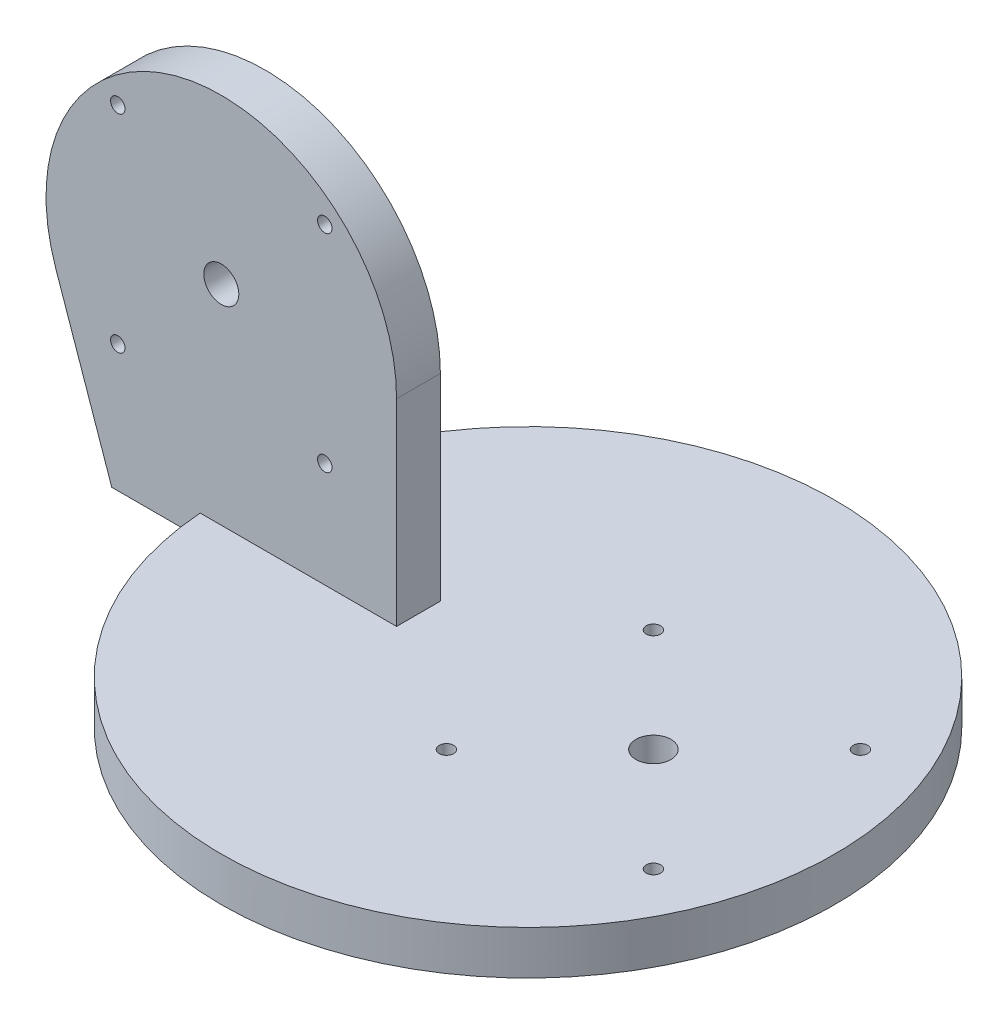
ISO-10303-21;
HEADER;
FILE_DESCRIPTION(('STEP AP214'),'2;1');
FILE_NAME('part.step','',(''),(''),'','','');
FILE_SCHEMA(('AUTOMOTIVE_DESIGN { 1 0 10303 214 1 1 1 1 }'));
ENDSEC;
DATA;
#1=APPLICATION_CONTEXT('core data for automotive mechanical design processes');
#2=APPLICATION_PROTOCOL_DEFINITION('international standard','automotive_design',2000,#1);
#3=PRODUCT_CONTEXT('',#1,'mechanical');
#4=PRODUCT('Part','Part','',(#3));
#5=PRODUCT_RELATED_PRODUCT_CATEGORY('part','',(#4));
#6=PRODUCT_DEFINITION_FORMATION('','',#4);
#7=PRODUCT_DEFINITION_CONTEXT('part definition',#1,'design');
#8=PRODUCT_DEFINITION('design','',#6,#7);
#9=PRODUCT_DEFINITION_SHAPE('','',#8);
#10=(LENGTH_UNIT() NAMED_UNIT(*) SI_UNIT(.MILLI.,.METRE.));
#11=(NAMED_UNIT(*) PLANE_ANGLE_UNIT() SI_UNIT($,.RADIAN.));
#12=(NAMED_UNIT(*) SI_UNIT($,.STERADIAN.) SOLID_ANGLE_UNIT());
#13=UNCERTAINTY_MEASURE_WITH_UNIT(LENGTH_MEASURE(1.E-05),#10,'distance_accuracy_value','');
#14=(GEOMETRIC_REPRESENTATION_CONTEXT(3) GLOBAL_UNCERTAINTY_ASSIGNED_CONTEXT((#13)) GLOBAL_UNIT_ASSIGNED_CONTEXT((#10,
#11,#12)) REPRESENTATION_CONTEXT('',''));
#15=CARTESIAN_POINT('',(0.,0.,0.));
#16=DIRECTION('',(0.,0.,1.));
#17=DIRECTION('',(1.,0.,0.));
#18=AXIS2_PLACEMENT_3D('',#15,#16,#17);
#19=CARTESIAN_POINT('',(0.,10.,0.));
#20=DIRECTION('',(0.,-1.,0.));
#21=DIRECTION('',(0.,0.,-1.));
#22=AXIS2_PLACEMENT_3D('',#19,#20,#21);
#23=CYLINDRICAL_SURFACE('',#22,70.);
#24=CARTESIAN_POINT('',(0.,0.,0.));
#25=DIRECTION('',(0.,1.,0.));
#26=DIRECTION('',(0.,0.,1.));
#27=AXIS2_PLACEMENT_3D('',#24,#25,#26);
#28=CIRCLE('',#27,70.);
#29=CARTESIAN_POINT('',(0.,0.,70.));
#30=VERTEX_POINT('',#29);
#31=EDGE_CURVE('E198',#30,#30,#28,.T.);
#32=ORIENTED_EDGE('',*,*,#31,.T.);
#33=EDGE_LOOP('',(#32));
#34=FACE_BOUND('',#33,.T.);
#35=DIRECTION('',(0.,-1.,0.));
#36=VECTOR('',#35,1.);
#37=CARTESIAN_POINT('',(-69.8212002188447,10.,5.));
#38=LINE('',#37,#36);
#39=CARTESIAN_POINT('',(-69.8212002188447,4.99999999999999,5.));
#40=VERTEX_POINT('',#39);
#41=CARTESIAN_POINT('',(-69.8212002188447,10.,5.));
#42=VERTEX_POINT('',#41);
#43=EDGE_CURVE('E79',#40,#42,#38,.F.);
#44=ORIENTED_EDGE('',*,*,#43,.F.);
#45=CARTESIAN_POINT('',(0.,5.,0.));
#46=DIRECTION('',(0.,1.,0.));
#47=DIRECTION('',(-1.,0.,0.));
#48=AXIS2_PLACEMENT_3D('',#45,#46,#47);
#49=CIRCLE('',#48,70.);
#50=CARTESIAN_POINT('',(-69.8212002188447,4.99999999999999,-5.));
#51=VERTEX_POINT('',#50);
#52=EDGE_CURVE('E12',#51,#40,#49,.T.);
#53=ORIENTED_EDGE('',*,*,#52,.F.);
#54=DIRECTION('',(0.,-1.,0.));
#55=VECTOR('',#54,1.);
#56=CARTESIAN_POINT('',(-69.8212002188447,10.,-5.));
#57=LINE('',#56,#55);
#58=CARTESIAN_POINT('',(-69.8212002188447,10.,-5.));
#59=VERTEX_POINT('',#58);
#60=EDGE_CURVE('E189',#51,#59,#57,.F.);
#61=ORIENTED_EDGE('',*,*,#60,.T.);
#62=CARTESIAN_POINT('',(0.,10.,0.));
#63=DIRECTION('',(0.,1.,0.));
#64=DIRECTION('',(0.,0.,1.));
#65=AXIS2_PLACEMENT_3D('',#62,#63,#64);
#66=CIRCLE('',#65,70.);
#67=EDGE_CURVE('E199',#42,#59,#66,.T.);
#68=ORIENTED_EDGE('',*,*,#67,.F.);
#69=EDGE_LOOP('',(#44,#53,#61,#68));
#70=FACE_BOUND('',#69,.T.);
#71=ADVANCED_FACE('F63',(#34,#70),#23,.T.);
#72=CARTESIAN_POINT('',(0.,10.,0.));
#73=DIRECTION('',(0.,1.,0.));
#74=DIRECTION('',(0.,0.,1.));
#75=AXIS2_PLACEMENT_3D('',#72,#73,#74);
#76=PLANE('',#75);
#77=CARTESIAN_POINT('',(28.62,10.,0.));
#78=DIRECTION('',(0.,1.,0.));
#79=DIRECTION('',(0.,0.,1.));
#80=AXIS2_PLACEMENT_3D('',#77,#78,#79);
#81=CIRCLE('',#80,4.);
#82=CARTESIAN_POINT('',(28.62,10.,4.));
#83=VERTEX_POINT('',#82);
#84=EDGE_CURVE('E212',#83,#83,#81,.T.);
#85=ORIENTED_EDGE('',*,*,#84,.F.);
#86=EDGE_LOOP('',(#85));
#87=FACE_BOUND('',#86,.T.);
#88=CARTESIAN_POINT('',(5.,10.,-23.62));
#89=DIRECTION('',(0.,1.,0.));
#90=DIRECTION('',(0.,0.,1.));
#91=AXIS2_PLACEMENT_3D('',#88,#89,#90);
#92=CIRCLE('',#91,1.64999999999999);
#93=CARTESIAN_POINT('',(5.,10.,-21.97));
#94=VERTEX_POINT('',#93);
#95=EDGE_CURVE('E136',#94,#94,#92,.T.);
#96=ORIENTED_EDGE('',*,*,#95,.F.);
#97=EDGE_LOOP('',(#96));
#98=FACE_BOUND('',#97,.T.);
#99=CARTESIAN_POINT('',(52.24,10.,-23.62));
#100=DIRECTION('',(0.,1.,0.));
#101=DIRECTION('',(0.,0.,1.));
#102=AXIS2_PLACEMENT_3D('',#99,#100,#101);
#103=CIRCLE('',#102,1.64999999999999);
#104=CARTESIAN_POINT('',(52.24,10.,-21.97));
#105=VERTEX_POINT('',#104);
#106=EDGE_CURVE('E135',#105,#105,#103,.T.);
#107=ORIENTED_EDGE('',*,*,#106,.F.);
#108=EDGE_LOOP('',(#107));
#109=FACE_BOUND('',#108,.T.);
#110=CARTESIAN_POINT('',(52.24,10.,23.62));
#111=DIRECTION('',(0.,1.,0.));
#112=DIRECTION('',(0.,0.,1.));
#113=AXIS2_PLACEMENT_3D('',#110,#111,#112);
#114=CIRCLE('',#113,1.64999999999999);
#115=CARTESIAN_POINT('',(52.24,10.,25.27));
#116=VERTEX_POINT('',#115);
#117=EDGE_CURVE('E148',#116,#116,#114,.T.);
#118=ORIENTED_EDGE('',*,*,#117,.F.);
#119=EDGE_LOOP('',(#118));
#120=FACE_BOUND('',#119,.T.);
#121=CARTESIAN_POINT('',(5.,10.,23.62));
#122=DIRECTION('',(0.,1.,0.));
#123=DIRECTION('',(0.,0.,1.));
#124=AXIS2_PLACEMENT_3D('',#121,#122,#123);
#125=CIRCLE('',#124,1.64999999999999);
#126=CARTESIAN_POINT('',(5.,10.,25.27));
#127=VERTEX_POINT('',#126);
#128=EDGE_CURVE('E154',#127,#127,#125,.T.);
#129=ORIENTED_EDGE('',*,*,#128,.F.);
#130=EDGE_LOOP('',(#129));
#131=FACE_BOUND('',#130,.T.);
#132=DIRECTION('',(0.,0.,1.));
#133=VECTOR('',#132,1.);
#134=CARTESIAN_POINT('',(-25.,10.,0.));
#135=LINE('',#134,#133);
#136=CARTESIAN_POINT('',(-25.,10.,-5.));
#137=VERTEX_POINT('',#136);
#138=CARTESIAN_POINT('',(-25.,10.,5.));
#139=VERTEX_POINT('',#138);
#140=EDGE_CURVE('E206',#137,#139,#135,.T.);
#141=ORIENTED_EDGE('',*,*,#140,.T.);
#142=DIRECTION('',(-1.,0.,0.));
#143=VECTOR('',#142,1.);
#144=CARTESIAN_POINT('',(0.,10.,5.));
#145=LINE('',#144,#143);
#146=EDGE_CURVE('E71',#139,#42,#145,.T.);
#147=ORIENTED_EDGE('',*,*,#146,.T.);
#148=ORIENTED_EDGE('',*,*,#67,.T.);
#149=DIRECTION('',(-1.,0.,0.));
#150=VECTOR('',#149,1.);
#151=CARTESIAN_POINT('',(0.,10.,-5.));
#152=LINE('',#151,#150);
#153=EDGE_CURVE('E201',#137,#59,#152,.T.);
#154=ORIENTED_EDGE('',*,*,#153,.F.);
#155=EDGE_LOOP('',(#141,#147,#148,#154));
#156=FACE_BOUND('',#155,.T.);
#157=ADVANCED_FACE('F254',(#87,#98,#109,#120,#131,#156),#76,.T.);
#158=CARTESIAN_POINT('',(0.,0.,0.));
#159=DIRECTION('',(0.,1.,0.));
#160=DIRECTION('',(0.,0.,1.));
#161=AXIS2_PLACEMENT_3D('',#158,#159,#160);
#162=PLANE('',#161);
#163=CARTESIAN_POINT('',(0.,0.,0.));
#164=DIRECTION('',(0.,1.,0.));
#165=DIRECTION('',(0.,0.,1.));
#166=AXIS2_PLACEMENT_3D('',#163,#164,#165);
#167=CIRCLE('',#166,65.);
#168=CARTESIAN_POINT('',(0.,0.,65.));
#169=VERTEX_POINT('',#168);
#170=EDGE_CURVE('E192',#169,#169,#167,.T.);
#171=ORIENTED_EDGE('',*,*,#170,.T.);
#172=EDGE_LOOP('',(#171));
#173=FACE_BOUND('',#172,.T.);
#174=ORIENTED_EDGE('',*,*,#31,.F.);
#175=EDGE_LOOP('',(#174));
#176=FACE_BOUND('',#175,.T.);
#177=ADVANCED_FACE('F257',(#173,#176),#162,.F.);
#178=CARTESIAN_POINT('',(0.,-3.,0.));
#179=DIRECTION('',(0.,-1.,0.));
#180=DIRECTION('',(0.,0.,-1.));
#181=AXIS2_PLACEMENT_3D('',#178,#179,#180);
#182=PLANE('',#181);
#183=CARTESIAN_POINT('',(28.62,-3.,0.));
#184=DIRECTION('',(0.,1.,0.));
#185=DIRECTION('',(0.,0.,1.));
#186=AXIS2_PLACEMENT_3D('',#183,#184,#185);
#187=CIRCLE('',#186,3.99999999999999);
#188=CARTESIAN_POINT('',(28.62,-3.,3.99999999999999));
#189=VERTEX_POINT('',#188);
#190=EDGE_CURVE('E142',#189,#189,#187,.T.);
#191=ORIENTED_EDGE('',*,*,#190,.T.);
#192=EDGE_LOOP('',(#191));
#193=FACE_BOUND('',#192,.T.);
#194=CARTESIAN_POINT('',(0.,-3.,0.));
#195=DIRECTION('',(0.,1.,0.));
#196=DIRECTION('',(0.,0.,1.));
#197=AXIS2_PLACEMENT_3D('',#194,#195,#196);
#198=CIRCLE('',#197,65.);
#199=CARTESIAN_POINT('',(0.,-3.,65.));
#200=VERTEX_POINT('',#199);
#201=EDGE_CURVE('E195',#200,#200,#198,.T.);
#202=ORIENTED_EDGE('',*,*,#201,.F.);
#203=EDGE_LOOP('',(#202));
#204=FACE_BOUND('',#203,.T.);
#205=ADVANCED_FACE('F244',(#193,#204),#182,.T.);
#206=CARTESIAN_POINT('',(0.,0.,0.));
#207=DIRECTION('',(0.,-1.,0.));
#208=DIRECTION('',(0.,0.,-1.));
#209=AXIS2_PLACEMENT_3D('',#206,#207,#208);
#210=CYLINDRICAL_SURFACE('',#209,65.);
#211=ORIENTED_EDGE('',*,*,#170,.F.);
#212=EDGE_LOOP('',(#211));
#213=FACE_BOUND('',#212,.T.);
#214=ORIENTED_EDGE('',*,*,#201,.T.);
#215=EDGE_LOOP('',(#214));
#216=FACE_BOUND('',#215,.T.);
#217=ADVANCED_FACE('F298',(#213,#216),#210,.T.);
#218=CARTESIAN_POINT('',(-65.,55.,5.));
#219=DIRECTION('',(0.,0.,-1.));
#220=DIRECTION('',(-1.,0.,0.));
#221=AXIS2_PLACEMENT_3D('',#218,#219,#220);
#222=PLANE('',#221);
#223=CARTESIAN_POINT('',(-88.62,81.2592930906025,5.));
#224=DIRECTION('',(0.,0.,1.));
#225=DIRECTION('',(1.,0.,0.));
#226=AXIS2_PLACEMENT_3D('',#223,#224,#225);
#227=CIRCLE('',#226,1.64999999999998);
#228=CARTESIAN_POINT('',(-86.97,81.2592930906025,5.));
#229=VERTEX_POINT('',#228);
#230=EDGE_CURVE('E233',#229,#229,#227,.T.);
#231=ORIENTED_EDGE('',*,*,#230,.F.);
#232=EDGE_LOOP('',(#231));
#233=FACE_BOUND('',#232,.T.);
#234=CARTESIAN_POINT('',(-41.38,81.2592930906025,5.));
#235=DIRECTION('',(0.,0.,1.));
#236=DIRECTION('',(1.,0.,0.));
#237=AXIS2_PLACEMENT_3D('',#234,#235,#236);
#238=CIRCLE('',#237,1.64999999999999);
#239=CARTESIAN_POINT('',(-39.73,81.2592930906025,5.));
#240=VERTEX_POINT('',#239);
#241=EDGE_CURVE('E223',#240,#240,#238,.T.);
#242=ORIENTED_EDGE('',*,*,#241,.F.);
#243=EDGE_LOOP('',(#242));
#244=FACE_BOUND('',#243,.T.);
#245=CARTESIAN_POINT('',(-41.38,34.0192930906024,5.));
#246=DIRECTION('',(0.,0.,1.));
#247=DIRECTION('',(1.,0.,0.));
#248=AXIS2_PLACEMENT_3D('',#245,#246,#247);
#249=CIRCLE('',#248,1.64999999999999);
#250=CARTESIAN_POINT('',(-39.73,34.0192930906024,5.));
#251=VERTEX_POINT('',#250);
#252=EDGE_CURVE('E220',#251,#251,#249,.T.);
#253=ORIENTED_EDGE('',*,*,#252,.F.);
#254=EDGE_LOOP('',(#253));
#255=FACE_BOUND('',#254,.T.);
#256=CARTESIAN_POINT('',(-88.62,34.0192930906024,5.));
#257=DIRECTION('',(0.,0.,1.));
#258=DIRECTION('',(1.,0.,0.));
#259=AXIS2_PLACEMENT_3D('',#256,#257,#258);
#260=CIRCLE('',#259,1.64999999999998);
#261=CARTESIAN_POINT('',(-86.97,34.0192930906024,5.));
#262=VERTEX_POINT('',#261);
#263=EDGE_CURVE('E217',#262,#262,#260,.T.);
#264=ORIENTED_EDGE('',*,*,#263,.F.);
#265=EDGE_LOOP('',(#264));
#266=FACE_BOUND('',#265,.T.);
#267=CARTESIAN_POINT('',(-65.,57.6392930906025,5.));
#268=DIRECTION('',(0.,0.,1.));
#269=DIRECTION('',(1.,0.,0.));
#270=AXIS2_PLACEMENT_3D('',#267,#268,#269);
#271=CIRCLE('',#270,4.);
#272=CARTESIAN_POINT('',(-61.,57.6392930906025,5.));
#273=VERTEX_POINT('',#272);
#274=EDGE_CURVE('E213',#273,#273,#271,.T.);
#275=ORIENTED_EDGE('',*,*,#274,.F.);
#276=EDGE_LOOP('',(#275));
#277=FACE_BOUND('',#276,.T.);
#278=DIRECTION('',(1.,0.,0.));
#279=VECTOR('',#278,1.);
#280=CARTESIAN_POINT('',(-25.,4.99999999999999,5.));
#281=LINE('',#280,#279);
#282=CARTESIAN_POINT('',(-90.,4.99999999999999,5.));
#283=VERTEX_POINT('',#282);
#284=EDGE_CURVE('E167',#283,#40,#281,.T.);
#285=ORIENTED_EDGE('',*,*,#284,.T.);
#286=ORIENTED_EDGE('',*,*,#43,.T.);
#287=ORIENTED_EDGE('',*,*,#146,.F.);
#288=DIRECTION('',(0.,1.,0.));
#289=VECTOR('',#288,1.);
#290=CARTESIAN_POINT('',(-25.,55.,5.));
#291=LINE('',#290,#289);
#292=CARTESIAN_POINT('',(-25.,55.,5.));
#293=VERTEX_POINT('',#292);
#294=EDGE_CURVE('E170',#139,#293,#291,.T.);
#295=ORIENTED_EDGE('',*,*,#294,.T.);
#296=CARTESIAN_POINT('',(-65.,55.,5.));
#297=DIRECTION('',(0.,0.,1.));
#298=DIRECTION('',(-1.,0.,0.));
#299=AXIS2_PLACEMENT_3D('',#296,#297,#298);
#300=CIRCLE('',#299,40.);
#301=CARTESIAN_POINT('',(-102.792798962901,41.8963994814506,5.));
#302=VERTEX_POINT('',#301);
#303=EDGE_CURVE('E161',#293,#302,#300,.T.);
#304=ORIENTED_EDGE('',*,*,#303,.T.);
#305=DIRECTION('',(0.327590012963735,-0.944819974072532,0.));
#306=VECTOR('',#305,1.);
#307=CARTESIAN_POINT('',(-90.,4.99999999999999,5.));
#308=LINE('',#307,#306);
#309=EDGE_CURVE('E164',#302,#283,#308,.T.);
#310=ORIENTED_EDGE('',*,*,#309,.T.);
#311=EDGE_LOOP('',(#285,#286,#287,#295,#304,#310));
#312=FACE_BOUND('',#311,.T.);
#313=ADVANCED_FACE('F273',(#233,#244,#255,#266,#277,#312),#222,.F.);
#314=CARTESIAN_POINT('',(-65.,55.,-5.));
#315=DIRECTION('',(0.,0.,-1.));
#316=DIRECTION('',(-1.,0.,0.));
#317=AXIS2_PLACEMENT_3D('',#314,#315,#316);
#318=PLANE('',#317);
#319=CARTESIAN_POINT('',(-88.62,81.2592930906025,-5.));
#320=DIRECTION('',(0.,0.,-1.));
#321=DIRECTION('',(-1.,0.,0.));
#322=AXIS2_PLACEMENT_3D('',#319,#320,#321);
#323=CIRCLE('',#322,1.64999999999998);
#324=CARTESIAN_POINT('',(-90.27,81.2592930906025,-5.));
#325=VERTEX_POINT('',#324);
#326=EDGE_CURVE('E66',#325,#325,#323,.T.);
#327=ORIENTED_EDGE('',*,*,#326,.F.);
#328=EDGE_LOOP('',(#327));
#329=FACE_BOUND('',#328,.T.);
#330=CARTESIAN_POINT('',(-41.38,81.2592930906025,-5.));
#331=DIRECTION('',(0.,0.,-1.));
#332=DIRECTION('',(-1.,0.,0.));
#333=AXIS2_PLACEMENT_3D('',#330,#331,#332);
#334=CIRCLE('',#333,1.64999999999999);
#335=CARTESIAN_POINT('',(-43.03,81.2592930906025,-5.));
#336=VERTEX_POINT('',#335);
#337=EDGE_CURVE('E221',#336,#336,#334,.T.);
#338=ORIENTED_EDGE('',*,*,#337,.F.);
#339=EDGE_LOOP('',(#338));
#340=FACE_BOUND('',#339,.T.);
#341=CARTESIAN_POINT('',(-41.38,34.0192930906024,-5.));
#342=DIRECTION('',(0.,0.,-1.));
#343=DIRECTION('',(-1.,0.,0.));
#344=AXIS2_PLACEMENT_3D('',#341,#342,#343);
#345=CIRCLE('',#344,1.64999999999999);
#346=CARTESIAN_POINT('',(-43.03,34.0192930906024,-5.));
#347=VERTEX_POINT('',#346);
#348=EDGE_CURVE('E218',#347,#347,#345,.T.);
#349=ORIENTED_EDGE('',*,*,#348,.F.);
#350=EDGE_LOOP('',(#349));
#351=FACE_BOUND('',#350,.T.);
#352=CARTESIAN_POINT('',(-88.62,34.0192930906024,-5.));
#353=DIRECTION('',(0.,0.,-1.));
#354=DIRECTION('',(-1.,0.,0.));
#355=AXIS2_PLACEMENT_3D('',#352,#353,#354);
#356=CIRCLE('',#355,1.64999999999998);
#357=CARTESIAN_POINT('',(-90.27,34.0192930906024,-5.));
#358=VERTEX_POINT('',#357);
#359=EDGE_CURVE('E214',#358,#358,#356,.T.);
#360=ORIENTED_EDGE('',*,*,#359,.F.);
#361=EDGE_LOOP('',(#360));
#362=FACE_BOUND('',#361,.T.);
#363=CARTESIAN_POINT('',(-65.,57.6392930906025,-5.));
#364=DIRECTION('',(0.,0.,-1.));
#365=DIRECTION('',(-1.,0.,0.));
#366=AXIS2_PLACEMENT_3D('',#363,#364,#365);
#367=CIRCLE('',#366,3.99999999999999);
#368=CARTESIAN_POINT('',(-69.,57.6392930906025,-5.));
#369=VERTEX_POINT('',#368);
#370=EDGE_CURVE('E209',#369,#369,#367,.T.);
#371=ORIENTED_EDGE('',*,*,#370,.F.);
#372=EDGE_LOOP('',(#371));
#373=FACE_BOUND('',#372,.T.);
#374=ORIENTED_EDGE('',*,*,#60,.F.);
#375=DIRECTION('',(1.,0.,0.));
#376=VECTOR('',#375,1.);
#377=CARTESIAN_POINT('',(-25.,4.99999999999999,-5.));
#378=LINE('',#377,#376);
#379=CARTESIAN_POINT('',(-90.,4.99999999999999,-5.));
#380=VERTEX_POINT('',#379);
#381=EDGE_CURVE('E177',#380,#51,#378,.T.);
#382=ORIENTED_EDGE('',*,*,#381,.F.);
#383=DIRECTION('',(0.327590012963735,-0.944819974072532,0.));
#384=VECTOR('',#383,1.);
#385=CARTESIAN_POINT('',(-90.,4.99999999999999,-5.));
#386=LINE('',#385,#384);
#387=CARTESIAN_POINT('',(-102.792798962901,41.8963994814506,-5.));
#388=VERTEX_POINT('',#387);
#389=EDGE_CURVE('E175',#388,#380,#386,.T.);
#390=ORIENTED_EDGE('',*,*,#389,.F.);
#391=CARTESIAN_POINT('',(-65.,55.,-5.));
#392=DIRECTION('',(0.,0.,1.));
#393=DIRECTION('',(-1.,0.,0.));
#394=AXIS2_PLACEMENT_3D('',#391,#392,#393);
#395=CIRCLE('',#394,40.);
#396=CARTESIAN_POINT('',(-25.,55.,-5.));
#397=VERTEX_POINT('',#396);
#398=EDGE_CURVE('E160',#397,#388,#395,.T.);
#399=ORIENTED_EDGE('',*,*,#398,.F.);
#400=DIRECTION('',(0.,1.,0.));
#401=VECTOR('',#400,1.);
#402=CARTESIAN_POINT('',(-25.,55.,-5.));
#403=LINE('',#402,#401);
#404=EDGE_CURVE('E165',#137,#397,#403,.T.);
#405=ORIENTED_EDGE('',*,*,#404,.F.);
#406=ORIENTED_EDGE('',*,*,#153,.T.);
#407=EDGE_LOOP('',(#374,#382,#390,#399,#405,#406));
#408=FACE_BOUND('',#407,.T.);
#409=ADVANCED_FACE('F289',(#329,#340,#351,#362,#373,#408),#318,.T.);
#410=CARTESIAN_POINT('',(-65.,55.,5.));
#411=DIRECTION('',(0.,0.,-1.));
#412=DIRECTION('',(-1.,0.,0.));
#413=AXIS2_PLACEMENT_3D('',#410,#411,#412);
#414=CYLINDRICAL_SURFACE('',#413,40.);
#415=ORIENTED_EDGE('',*,*,#398,.T.);
#416=DIRECTION('',(0.,0.,-1.));
#417=VECTOR('',#416,1.);
#418=CARTESIAN_POINT('',(-102.792798962901,41.8963994814506,5.));
#419=LINE('',#418,#417);
#420=EDGE_CURVE('E186',#302,#388,#419,.T.);
#421=ORIENTED_EDGE('',*,*,#420,.F.);
#422=ORIENTED_EDGE('',*,*,#303,.F.);
#423=DIRECTION('',(0.,0.,-1.));
#424=VECTOR('',#423,1.);
#425=CARTESIAN_POINT('',(-25.,55.,5.));
#426=LINE('',#425,#424);
#427=EDGE_CURVE('E172',#293,#397,#426,.T.);
#428=ORIENTED_EDGE('',*,*,#427,.T.);
#429=EDGE_LOOP('',(#415,#421,#422,#428));
#430=FACE_BOUND('',#429,.T.);
#431=ADVANCED_FACE('F280',(#430),#414,.T.);
#432=CARTESIAN_POINT('',(-90.,4.99999999999999,5.));
#433=DIRECTION('',(0.944819974072532,0.327590012963735,0.));
#434=DIRECTION('',(-0.327590012963735,0.944819974072532,0.));
#435=AXIS2_PLACEMENT_3D('',#432,#433,#434);
#436=PLANE('',#435);
#437=ORIENTED_EDGE('',*,*,#389,.T.);
#438=DIRECTION('',(0.,0.,-1.));
#439=VECTOR('',#438,1.);
#440=CARTESIAN_POINT('',(-90.,4.99999999999999,5.));
#441=LINE('',#440,#439);
#442=EDGE_CURVE('E183',#283,#380,#441,.T.);
#443=ORIENTED_EDGE('',*,*,#442,.F.);
#444=ORIENTED_EDGE('',*,*,#309,.F.);
#445=ORIENTED_EDGE('',*,*,#420,.T.);
#446=EDGE_LOOP('',(#437,#443,#444,#445));
#447=FACE_BOUND('',#446,.T.);
#448=ADVANCED_FACE('F284',(#447),#436,.F.);
#449=CARTESIAN_POINT('',(-25.,4.99999999999999,5.));
#450=DIRECTION('',(0.,1.,0.));
#451=DIRECTION('',(-1.,0.,0.));
#452=AXIS2_PLACEMENT_3D('',#449,#450,#451);
#453=PLANE('',#452);
#454=ORIENTED_EDGE('',*,*,#381,.T.);
#455=ORIENTED_EDGE('',*,*,#52,.T.);
#456=ORIENTED_EDGE('',*,*,#284,.F.);
#457=ORIENTED_EDGE('',*,*,#442,.T.);
#458=EDGE_LOOP('',(#454,#455,#456,#457));
#459=FACE_BOUND('',#458,.T.);
#460=ADVANCED_FACE('F287',(#459),#453,.F.);
#461=CARTESIAN_POINT('',(-25.,55.,5.));
#462=DIRECTION('',(-1.,0.,0.));
#463=DIRECTION('',(0.,-1.,0.));
#464=AXIS2_PLACEMENT_3D('',#461,#462,#463);
#465=PLANE('',#464);
#466=ORIENTED_EDGE('',*,*,#140,.F.);
#467=ORIENTED_EDGE('',*,*,#404,.T.);
#468=ORIENTED_EDGE('',*,*,#427,.F.);
#469=ORIENTED_EDGE('',*,*,#294,.F.);
#470=EDGE_LOOP('',(#466,#467,#468,#469));
#471=FACE_BOUND('',#470,.T.);
#472=ADVANCED_FACE('F275',(#471),#465,.F.);
#473=CARTESIAN_POINT('',(5.,-0.0999999999999977,23.62));
#474=DIRECTION('',(0.,1.,0.));
#475=DIRECTION('',(0.,0.,1.));
#476=AXIS2_PLACEMENT_3D('',#473,#474,#475);
#477=CONICAL_SURFACE('',#476,1.64999999999999,1.02974425867665);
#478=CARTESIAN_POINT('',(5.,-1.09142002139547,23.62));
#479=VERTEX_POINT('',#478);
#480=VERTEX_LOOP('',#479);
#481=FACE_BOUND('',#480,.T.);
#482=CARTESIAN_POINT('',(5.,-0.0999999999999977,23.62));
#483=DIRECTION('',(0.,1.,0.));
#484=DIRECTION('',(0.,0.,1.));
#485=AXIS2_PLACEMENT_3D('',#482,#483,#484);
#486=CIRCLE('',#485,1.64999999999999);
#487=CARTESIAN_POINT('',(5.,-0.0999999999999977,25.27));
#488=VERTEX_POINT('',#487);
#489=EDGE_CURVE('E157',#488,#488,#486,.T.);
#490=ORIENTED_EDGE('',*,*,#489,.T.);
#491=EDGE_LOOP('',(#490));
#492=FACE_BOUND('',#491,.T.);
#493=ADVANCED_FACE('F322',(#481,#492),#477,.F.);
#494=CARTESIAN_POINT('',(5.,10.,23.62));
#495=DIRECTION('',(0.,1.,0.));
#496=DIRECTION('',(0.,0.,1.));
#497=AXIS2_PLACEMENT_3D('',#494,#495,#496);
#498=CYLINDRICAL_SURFACE('',#497,1.64999999999999);
#499=ORIENTED_EDGE('',*,*,#489,.F.);
#500=EDGE_LOOP('',(#499));
#501=FACE_BOUND('',#500,.T.);
#502=ORIENTED_EDGE('',*,*,#128,.T.);
#503=EDGE_LOOP('',(#502));
#504=FACE_BOUND('',#503,.T.);
#505=ADVANCED_FACE('F328',(#501,#504),#498,.F.);
#506=CARTESIAN_POINT('',(52.24,-0.0999999999999977,23.62));
#507=DIRECTION('',(0.,1.,0.));
#508=DIRECTION('',(0.,0.,1.));
#509=AXIS2_PLACEMENT_3D('',#506,#507,#508);
#510=CONICAL_SURFACE('',#509,1.64999999999998,1.02974425867665);
#511=CARTESIAN_POINT('',(52.24,-1.09142002139547,23.62));
#512=VERTEX_POINT('',#511);
#513=VERTEX_LOOP('',#512);
#514=FACE_BOUND('',#513,.T.);
#515=CARTESIAN_POINT('',(52.24,-0.0999999999999977,23.62));
#516=DIRECTION('',(0.,1.,0.));
#517=DIRECTION('',(0.,0.,1.));
#518=AXIS2_PLACEMENT_3D('',#515,#516,#517);
#519=CIRCLE('',#518,1.64999999999998);
#520=CARTESIAN_POINT('',(52.24,-0.0999999999999977,25.27));
#521=VERTEX_POINT('',#520);
#522=EDGE_CURVE('E151',#521,#521,#519,.T.);
#523=ORIENTED_EDGE('',*,*,#522,.T.);
#524=EDGE_LOOP('',(#523));
#525=FACE_BOUND('',#524,.T.);
#526=ADVANCED_FACE('F332',(#514,#525),#510,.F.);
#527=CARTESIAN_POINT('',(52.24,10.,23.62));
#528=DIRECTION('',(0.,1.,0.));
#529=DIRECTION('',(0.,0.,1.));
#530=AXIS2_PLACEMENT_3D('',#527,#528,#529);
#531=CYLINDRICAL_SURFACE('',#530,1.64999999999999);
#532=ORIENTED_EDGE('',*,*,#522,.F.);
#533=EDGE_LOOP('',(#532));
#534=FACE_BOUND('',#533,.T.);
#535=ORIENTED_EDGE('',*,*,#117,.T.);
#536=EDGE_LOOP('',(#535));
#537=FACE_BOUND('',#536,.T.);
#538=ADVANCED_FACE('F336',(#534,#537),#531,.F.);
#539=CARTESIAN_POINT('',(52.24,-0.0999999999999977,-23.62));
#540=DIRECTION('',(0.,1.,0.));
#541=DIRECTION('',(0.,0.,1.));
#542=AXIS2_PLACEMENT_3D('',#539,#540,#541);
#543=CONICAL_SURFACE('',#542,1.64999999999998,1.02974425867665);
#544=CARTESIAN_POINT('',(52.24,-1.09142002139547,-23.62));
#545=VERTEX_POINT('',#544);
#546=VERTEX_LOOP('',#545);
#547=FACE_BOUND('',#546,.T.);
#548=CARTESIAN_POINT('',(52.24,-0.0999999999999977,-23.62));
#549=DIRECTION('',(0.,1.,0.));
#550=DIRECTION('',(0.,0.,1.));
#551=AXIS2_PLACEMENT_3D('',#548,#549,#550);
#552=CIRCLE('',#551,1.64999999999998);
#553=CARTESIAN_POINT('',(52.24,-0.0999999999999977,-21.97));
#554=VERTEX_POINT('',#553);
#555=EDGE_CURVE('E139',#554,#554,#552,.T.);
#556=ORIENTED_EDGE('',*,*,#555,.T.);
#557=EDGE_LOOP('',(#556));
#558=FACE_BOUND('',#557,.T.);
#559=ADVANCED_FACE('F340',(#547,#558),#543,.F.);
#560=CARTESIAN_POINT('',(52.24,10.,-23.62));
#561=DIRECTION('',(0.,1.,0.));
#562=DIRECTION('',(0.,0.,1.));
#563=AXIS2_PLACEMENT_3D('',#560,#561,#562);
#564=CYLINDRICAL_SURFACE('',#563,1.64999999999999);
#565=ORIENTED_EDGE('',*,*,#555,.F.);
#566=EDGE_LOOP('',(#565));
#567=FACE_BOUND('',#566,.T.);
#568=ORIENTED_EDGE('',*,*,#106,.T.);
#569=EDGE_LOOP('',(#568));
#570=FACE_BOUND('',#569,.T.);
#571=ADVANCED_FACE('F129',(#567,#570),#564,.F.);
#572=CARTESIAN_POINT('',(5.,-0.0999999999999977,-23.62));
#573=DIRECTION('',(0.,1.,0.));
#574=DIRECTION('',(0.,0.,1.));
#575=AXIS2_PLACEMENT_3D('',#572,#573,#574);
#576=CONICAL_SURFACE('',#575,1.64999999999999,1.02974425867665);
#577=CARTESIAN_POINT('',(5.,-1.09142002139547,-23.62));
#578=VERTEX_POINT('',#577);
#579=VERTEX_LOOP('',#578);
#580=FACE_BOUND('',#579,.T.);
#581=CARTESIAN_POINT('',(5.,-0.0999999999999977,-23.62));
#582=DIRECTION('',(0.,1.,0.));
#583=DIRECTION('',(0.,0.,1.));
#584=AXIS2_PLACEMENT_3D('',#581,#582,#583);
#585=CIRCLE('',#584,1.64999999999999);
#586=CARTESIAN_POINT('',(5.,-0.0999999999999977,-21.97));
#587=VERTEX_POINT('',#586);
#588=EDGE_CURVE('E133',#587,#587,#585,.T.);
#589=ORIENTED_EDGE('',*,*,#588,.T.);
#590=EDGE_LOOP('',(#589));
#591=FACE_BOUND('',#590,.T.);
#592=ADVANCED_FACE('F125',(#580,#591),#576,.F.);
#593=CARTESIAN_POINT('',(5.,10.,-23.62));
#594=DIRECTION('',(0.,1.,0.));
#595=DIRECTION('',(0.,0.,1.));
#596=AXIS2_PLACEMENT_3D('',#593,#594,#595);
#597=CYLINDRICAL_SURFACE('',#596,1.64999999999999);
#598=ORIENTED_EDGE('',*,*,#588,.F.);
#599=EDGE_LOOP('',(#598));
#600=FACE_BOUND('',#599,.T.);
#601=ORIENTED_EDGE('',*,*,#95,.T.);
#602=EDGE_LOOP('',(#601));
#603=FACE_BOUND('',#602,.T.);
#604=ADVANCED_FACE('F128',(#600,#603),#597,.F.);
#605=CARTESIAN_POINT('',(28.62,10.,0.));
#606=DIRECTION('',(0.,1.,0.));
#607=DIRECTION('',(0.,0.,1.));
#608=AXIS2_PLACEMENT_3D('',#605,#606,#607);
#609=CYLINDRICAL_SURFACE('',#608,4.);
#610=ORIENTED_EDGE('',*,*,#190,.F.);
#611=EDGE_LOOP('',(#610));
#612=FACE_BOUND('',#611,.T.);
#613=ORIENTED_EDGE('',*,*,#84,.T.);
#614=EDGE_LOOP('',(#613));
#615=FACE_BOUND('',#614,.T.);
#616=ADVANCED_FACE('F247',(#612,#615),#609,.F.);
#617=CARTESIAN_POINT('',(-65.,57.6392930906025,5.));
#618=DIRECTION('',(0.,0.,1.));
#619=DIRECTION('',(1.,0.,0.));
#620=AXIS2_PLACEMENT_3D('',#617,#618,#619);
#621=CYLINDRICAL_SURFACE('',#620,3.99999999999999);
#622=ORIENTED_EDGE('',*,*,#370,.T.);
#623=EDGE_LOOP('',(#622));
#624=FACE_BOUND('',#623,.T.);
#625=ORIENTED_EDGE('',*,*,#274,.T.);
#626=EDGE_LOOP('',(#625));
#627=FACE_BOUND('',#626,.T.);
#628=ADVANCED_FACE('F250',(#624,#627),#621,.F.);
#629=CARTESIAN_POINT('',(-88.62,34.0192930906024,5.));
#630=DIRECTION('',(0.,0.,1.));
#631=DIRECTION('',(1.,0.,0.));
#632=AXIS2_PLACEMENT_3D('',#629,#630,#631);
#633=CYLINDRICAL_SURFACE('',#632,1.64999999999998);
#634=ORIENTED_EDGE('',*,*,#359,.T.);
#635=EDGE_LOOP('',(#634));
#636=FACE_BOUND('',#635,.T.);
#637=ORIENTED_EDGE('',*,*,#263,.T.);
#638=EDGE_LOOP('',(#637));
#639=FACE_BOUND('',#638,.T.);
#640=ADVANCED_FACE('F352',(#636,#639),#633,.F.);
#641=CARTESIAN_POINT('',(-41.38,34.0192930906024,5.));
#642=DIRECTION('',(0.,0.,1.));
#643=DIRECTION('',(1.,0.,0.));
#644=AXIS2_PLACEMENT_3D('',#641,#642,#643);
#645=CYLINDRICAL_SURFACE('',#644,1.64999999999999);
#646=ORIENTED_EDGE('',*,*,#348,.T.);
#647=EDGE_LOOP('',(#646));
#648=FACE_BOUND('',#647,.T.);
#649=ORIENTED_EDGE('',*,*,#252,.T.);
#650=EDGE_LOOP('',(#649));
#651=FACE_BOUND('',#650,.T.);
#652=ADVANCED_FACE('F356',(#648,#651),#645,.F.);
#653=CARTESIAN_POINT('',(-41.38,81.2592930906025,5.));
#654=DIRECTION('',(0.,0.,1.));
#655=DIRECTION('',(1.,0.,0.));
#656=AXIS2_PLACEMENT_3D('',#653,#654,#655);
#657=CYLINDRICAL_SURFACE('',#656,1.64999999999999);
#658=ORIENTED_EDGE('',*,*,#337,.T.);
#659=EDGE_LOOP('',(#658));
#660=FACE_BOUND('',#659,.T.);
#661=ORIENTED_EDGE('',*,*,#241,.T.);
#662=EDGE_LOOP('',(#661));
#663=FACE_BOUND('',#662,.T.);
#664=ADVANCED_FACE('F360',(#660,#663),#657,.F.);
#665=CARTESIAN_POINT('',(-88.62,81.2592930906025,5.));
#666=DIRECTION('',(0.,0.,1.));
#667=DIRECTION('',(1.,0.,0.));
#668=AXIS2_PLACEMENT_3D('',#665,#666,#667);
#669=CYLINDRICAL_SURFACE('',#668,1.64999999999998);
#670=ORIENTED_EDGE('',*,*,#326,.T.);
#671=EDGE_LOOP('',(#670));
#672=FACE_BOUND('',#671,.T.);
#673=ORIENTED_EDGE('',*,*,#230,.T.);
#674=EDGE_LOOP('',(#673));
#675=FACE_BOUND('',#674,.T.);
#676=ADVANCED_FACE('F364',(#672,#675),#669,.F.);
#677=CLOSED_SHELL('',(#71,#157,#177,#205,#217,#313,#409,#431,#448,#460,#472,#493,#505,#526,#538,
#559,#571,#592,#604,#616,#628,#640,#652,#664,#676));
#678=MANIFOLD_SOLID_BREP('B2',#677);
#679=ADVANCED_BREP_SHAPE_REPRESENTATION('',(#18,#678),#14);
#680=SHAPE_DEFINITION_REPRESENTATION(#9,#679);
ENDSEC;
END-ISO-10303-21;
